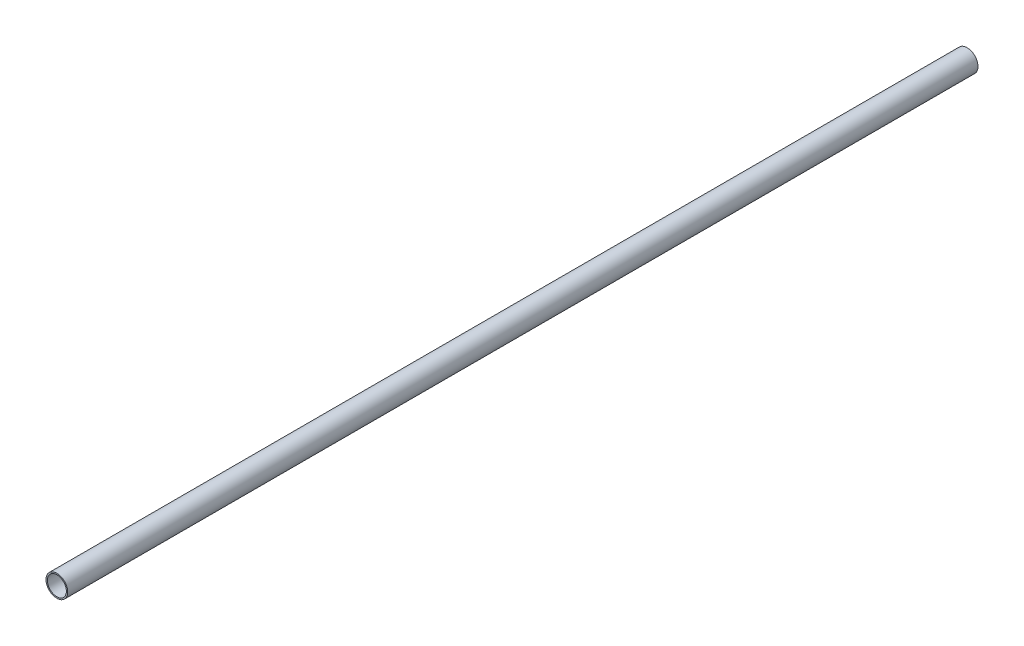
ISO-10303-21;
HEADER;
FILE_DESCRIPTION(('STEP AP214'),'2;1');
FILE_NAME('part.step','',(''),(''),'','','');
FILE_SCHEMA(('AUTOMOTIVE_DESIGN { 1 0 10303 214 1 1 1 1 }'));
ENDSEC;
DATA;
#1=APPLICATION_CONTEXT('core data for automotive mechanical design processes');
#2=APPLICATION_PROTOCOL_DEFINITION('international standard','automotive_design',2000,#1);
#3=PRODUCT_CONTEXT('',#1,'mechanical');
#4=PRODUCT('Part','Part','',(#3));
#5=PRODUCT_RELATED_PRODUCT_CATEGORY('part','',(#4));
#6=PRODUCT_DEFINITION_FORMATION('','',#4);
#7=PRODUCT_DEFINITION_CONTEXT('part definition',#1,'design');
#8=PRODUCT_DEFINITION('design','',#6,#7);
#9=PRODUCT_DEFINITION_SHAPE('','',#8);
#10=(LENGTH_UNIT() NAMED_UNIT(*) SI_UNIT(.MILLI.,.METRE.));
#11=(NAMED_UNIT(*) PLANE_ANGLE_UNIT() SI_UNIT($,.RADIAN.));
#12=(NAMED_UNIT(*) SI_UNIT($,.STERADIAN.) SOLID_ANGLE_UNIT());
#13=UNCERTAINTY_MEASURE_WITH_UNIT(LENGTH_MEASURE(1.E-05),#10,'distance_accuracy_value','');
#14=(GEOMETRIC_REPRESENTATION_CONTEXT(3) GLOBAL_UNCERTAINTY_ASSIGNED_CONTEXT((#13)) GLOBAL_UNIT_ASSIGNED_CONTEXT((#10,
#11,#12)) REPRESENTATION_CONTEXT('',''));
#15=CARTESIAN_POINT('',(0.,0.,0.));
#16=DIRECTION('',(0.,0.,1.));
#17=DIRECTION('',(1.,0.,0.));
#18=AXIS2_PLACEMENT_3D('',#15,#16,#17);
#19=CARTESIAN_POINT('',(0.,0.,335.));
#20=DIRECTION('',(0.,0.,1.));
#21=DIRECTION('',(1.,0.,0.));
#22=AXIS2_PLACEMENT_3D('',#19,#20,#21);
#23=PLANE('',#22);
#24=CARTESIAN_POINT('',(0.,0.,335.));
#25=DIRECTION('',(0.,0.,1.));
#26=DIRECTION('',(1.,0.,0.));
#27=AXIS2_PLACEMENT_3D('',#24,#25,#26);
#28=CIRCLE('',#27,4.);
#29=CARTESIAN_POINT('',(4.,0.,335.));
#30=VERTEX_POINT('',#29);
#31=EDGE_CURVE('E10',#30,#30,#28,.T.);
#32=ORIENTED_EDGE('',*,*,#31,.T.);
#33=EDGE_LOOP('',(#32));
#34=FACE_BOUND('',#33,.T.);
#35=CARTESIAN_POINT('',(0.,0.,335.));
#36=DIRECTION('',(0.,0.,1.));
#37=DIRECTION('',(1.,0.,0.));
#38=AXIS2_PLACEMENT_3D('',#35,#36,#37);
#39=CIRCLE('',#38,3.5);
#40=CARTESIAN_POINT('',(3.5,0.,335.));
#41=VERTEX_POINT('',#40);
#42=EDGE_CURVE('E52',#41,#41,#39,.T.);
#43=ORIENTED_EDGE('',*,*,#42,.F.);
#44=EDGE_LOOP('',(#43));
#45=FACE_BOUND('',#44,.T.);
#46=ADVANCED_FACE('F39',(#34,#45),#23,.T.);
#47=CARTESIAN_POINT('',(0.,0.,0.));
#48=DIRECTION('',(0.,0.,1.));
#49=DIRECTION('',(1.,0.,0.));
#50=AXIS2_PLACEMENT_3D('',#47,#48,#49);
#51=PLANE('',#50);
#52=CARTESIAN_POINT('',(0.,0.,0.));
#53=DIRECTION('',(0.,0.,1.));
#54=DIRECTION('',(1.,0.,0.));
#55=AXIS2_PLACEMENT_3D('',#52,#53,#54);
#56=CIRCLE('',#55,4.);
#57=CARTESIAN_POINT('',(4.,0.,0.));
#58=VERTEX_POINT('',#57);
#59=EDGE_CURVE('E43',#58,#58,#56,.T.);
#60=ORIENTED_EDGE('',*,*,#59,.F.);
#61=EDGE_LOOP('',(#60));
#62=FACE_BOUND('',#61,.T.);
#63=CARTESIAN_POINT('',(0.,0.,0.));
#64=DIRECTION('',(0.,0.,1.));
#65=DIRECTION('',(1.,0.,0.));
#66=AXIS2_PLACEMENT_3D('',#63,#64,#65);
#67=CIRCLE('',#66,3.5);
#68=CARTESIAN_POINT('',(3.5,0.,0.));
#69=VERTEX_POINT('',#68);
#70=EDGE_CURVE('E54',#69,#69,#67,.T.);
#71=ORIENTED_EDGE('',*,*,#70,.T.);
#72=EDGE_LOOP('',(#71));
#73=FACE_BOUND('',#72,.T.);
#74=ADVANCED_FACE('F66',(#62,#73),#51,.F.);
#75=CARTESIAN_POINT('',(0.,0.,335.));
#76=DIRECTION('',(0.,0.,-1.));
#77=DIRECTION('',(-1.,0.,0.));
#78=AXIS2_PLACEMENT_3D('',#75,#76,#77);
#79=CYLINDRICAL_SURFACE('',#78,4.);
#80=ORIENTED_EDGE('',*,*,#31,.F.);
#81=EDGE_LOOP('',(#80));
#82=FACE_BOUND('',#81,.T.);
#83=ORIENTED_EDGE('',*,*,#59,.T.);
#84=EDGE_LOOP('',(#83));
#85=FACE_BOUND('',#84,.T.);
#86=ADVANCED_FACE('F41',(#82,#85),#79,.T.);
#87=CARTESIAN_POINT('',(0.,0.,335.));
#88=DIRECTION('',(0.,0.,-1.));
#89=DIRECTION('',(-1.,0.,0.));
#90=AXIS2_PLACEMENT_3D('',#87,#88,#89);
#91=CYLINDRICAL_SURFACE('',#90,3.5);
#92=ORIENTED_EDGE('',*,*,#42,.T.);
#93=EDGE_LOOP('',(#92));
#94=FACE_BOUND('',#93,.T.);
#95=ORIENTED_EDGE('',*,*,#70,.F.);
#96=EDGE_LOOP('',(#95));
#97=FACE_BOUND('',#96,.T.);
#98=ADVANCED_FACE('F62',(#94,#97),#91,.F.);
#99=CLOSED_SHELL('',(#46,#74,#86,#98));
#100=MANIFOLD_SOLID_BREP('B2',#99);
#101=ADVANCED_BREP_SHAPE_REPRESENTATION('',(#18,#100),#14);
#102=SHAPE_DEFINITION_REPRESENTATION(#9,#101);
ENDSEC;
END-ISO-10303-21;
